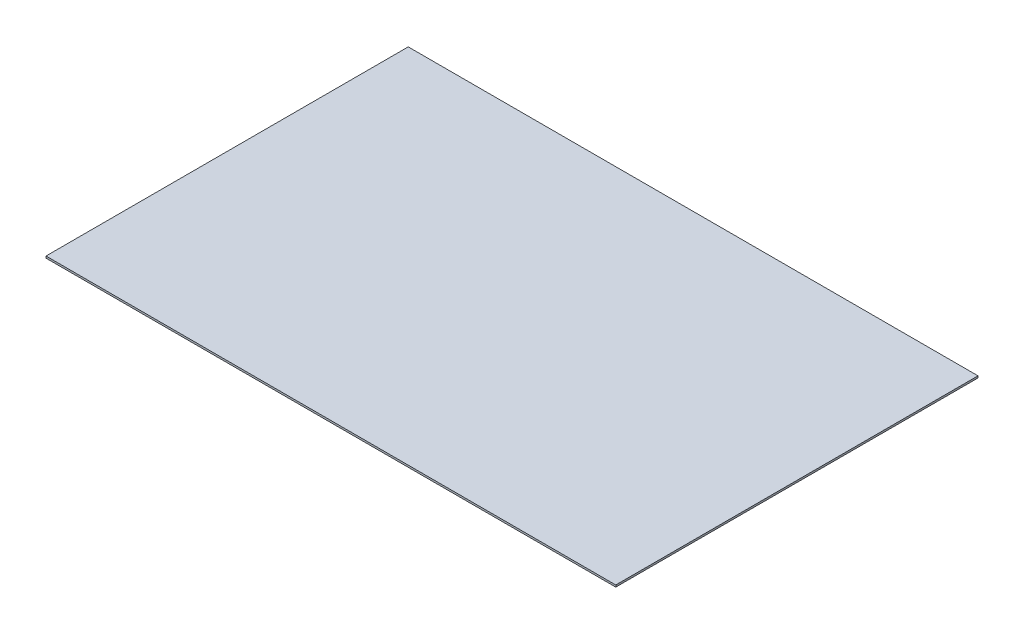
ISO-10303-21;
HEADER;
FILE_DESCRIPTION(('STEP AP214'),'2;1');
FILE_NAME('part.step','',(''),(''),'','','');
FILE_SCHEMA(('AUTOMOTIVE_DESIGN { 1 0 10303 214 1 1 1 1 }'));
ENDSEC;
DATA;
#1=APPLICATION_CONTEXT('core data for automotive mechanical design processes');
#2=APPLICATION_PROTOCOL_DEFINITION('international standard','automotive_design',2000,#1);
#3=PRODUCT_CONTEXT('',#1,'mechanical');
#4=PRODUCT('Part','Part','',(#3));
#5=PRODUCT_RELATED_PRODUCT_CATEGORY('part','',(#4));
#6=PRODUCT_DEFINITION_FORMATION('','',#4);
#7=PRODUCT_DEFINITION_CONTEXT('part definition',#1,'design');
#8=PRODUCT_DEFINITION('design','',#6,#7);
#9=PRODUCT_DEFINITION_SHAPE('','',#8);
#10=(LENGTH_UNIT() NAMED_UNIT(*) SI_UNIT(.MILLI.,.METRE.));
#11=(NAMED_UNIT(*) PLANE_ANGLE_UNIT() SI_UNIT($,.RADIAN.));
#12=(NAMED_UNIT(*) SI_UNIT($,.STERADIAN.) SOLID_ANGLE_UNIT());
#13=UNCERTAINTY_MEASURE_WITH_UNIT(LENGTH_MEASURE(1.E-05),#10,'distance_accuracy_value','');
#14=(GEOMETRIC_REPRESENTATION_CONTEXT(3) GLOBAL_UNCERTAINTY_ASSIGNED_CONTEXT((#13)) GLOBAL_UNIT_ASSIGNED_CONTEXT((#10,
#11,#12)) REPRESENTATION_CONTEXT('',''));
#15=CARTESIAN_POINT('',(0.,0.,0.));
#16=DIRECTION('',(0.,0.,1.));
#17=DIRECTION('',(1.,0.,0.));
#18=AXIS2_PLACEMENT_3D('',#15,#16,#17);
#19=CARTESIAN_POINT('',(239.7125,1.5875,-152.4));
#20=DIRECTION('',(-1.,0.,0.));
#21=DIRECTION('',(0.,0.,1.));
#22=AXIS2_PLACEMENT_3D('',#19,#20,#21);
#23=PLANE('',#22);
#24=DIRECTION('',(0.,0.,-1.));
#25=VECTOR('',#24,1.);
#26=CARTESIAN_POINT('',(239.7125,0.,-152.4));
#27=LINE('',#26,#25);
#28=CARTESIAN_POINT('',(239.7125,0.,152.4));
#29=VERTEX_POINT('',#28);
#30=CARTESIAN_POINT('',(239.7125,0.,-152.4));
#31=VERTEX_POINT('',#30);
#32=EDGE_CURVE('E98',#29,#31,#27,.T.);
#33=ORIENTED_EDGE('',*,*,#32,.T.);
#34=DIRECTION('',(0.,-1.,0.));
#35=VECTOR('',#34,1.);
#36=CARTESIAN_POINT('',(239.7125,1.5875,-152.4));
#37=LINE('',#36,#35);
#38=CARTESIAN_POINT('',(239.7125,1.5875,-152.4));
#39=VERTEX_POINT('',#38);
#40=EDGE_CURVE('E11',#39,#31,#37,.T.);
#41=ORIENTED_EDGE('',*,*,#40,.F.);
#42=DIRECTION('',(0.,0.,-1.));
#43=VECTOR('',#42,1.);
#44=CARTESIAN_POINT('',(239.7125,1.5875,-152.4));
#45=LINE('',#44,#43);
#46=CARTESIAN_POINT('',(239.7125,1.5875,152.4));
#47=VERTEX_POINT('',#46);
#48=EDGE_CURVE('E86',#47,#39,#45,.T.);
#49=ORIENTED_EDGE('',*,*,#48,.F.);
#50=DIRECTION('',(0.,-1.,0.));
#51=VECTOR('',#50,1.);
#52=CARTESIAN_POINT('',(239.7125,1.5875,152.4));
#53=LINE('',#52,#51);
#54=EDGE_CURVE('E94',#47,#29,#53,.T.);
#55=ORIENTED_EDGE('',*,*,#54,.T.);
#56=EDGE_LOOP('',(#33,#41,#49,#55));
#57=FACE_BOUND('',#56,.T.);
#58=ADVANCED_FACE('F35',(#57),#23,.F.);
#59=CARTESIAN_POINT('',(-239.7125,1.5875,-152.4));
#60=DIRECTION('',(0.,0.,1.));
#61=DIRECTION('',(1.,0.,0.));
#62=AXIS2_PLACEMENT_3D('',#59,#60,#61);
#63=PLANE('',#62);
#64=DIRECTION('',(-1.,0.,0.));
#65=VECTOR('',#64,1.);
#66=CARTESIAN_POINT('',(-239.7125,0.,-152.4));
#67=LINE('',#66,#65);
#68=CARTESIAN_POINT('',(-239.7125,0.,-152.4));
#69=VERTEX_POINT('',#68);
#70=EDGE_CURVE('E90',#31,#69,#67,.T.);
#71=ORIENTED_EDGE('',*,*,#70,.T.);
#72=DIRECTION('',(0.,-1.,0.));
#73=VECTOR('',#72,1.);
#74=CARTESIAN_POINT('',(-239.7125,1.5875,-152.4));
#75=LINE('',#74,#73);
#76=CARTESIAN_POINT('',(-239.7125,1.5875,-152.4));
#77=VERTEX_POINT('',#76);
#78=EDGE_CURVE('E43',#77,#69,#75,.T.);
#79=ORIENTED_EDGE('',*,*,#78,.F.);
#80=DIRECTION('',(-1.,0.,0.));
#81=VECTOR('',#80,1.);
#82=CARTESIAN_POINT('',(-239.7125,1.5875,-152.4));
#83=LINE('',#82,#81);
#84=EDGE_CURVE('E81',#39,#77,#83,.T.);
#85=ORIENTED_EDGE('',*,*,#84,.F.);
#86=ORIENTED_EDGE('',*,*,#40,.T.);
#87=EDGE_LOOP('',(#71,#79,#85,#86));
#88=FACE_BOUND('',#87,.T.);
#89=ADVANCED_FACE('F89',(#88),#63,.F.);
#90=CARTESIAN_POINT('',(-239.7125,1.5875,-152.4));
#91=DIRECTION('',(1.,0.,0.));
#92=DIRECTION('',(0.,0.,-1.));
#93=AXIS2_PLACEMENT_3D('',#90,#91,#92);
#94=PLANE('',#93);
#95=DIRECTION('',(0.,0.,1.));
#96=VECTOR('',#95,1.);
#97=CARTESIAN_POINT('',(-239.7125,0.,-152.4));
#98=LINE('',#97,#96);
#99=CARTESIAN_POINT('',(-239.7125,0.,152.4));
#100=VERTEX_POINT('',#99);
#101=EDGE_CURVE('E68',#69,#100,#98,.T.);
#102=ORIENTED_EDGE('',*,*,#101,.T.);
#103=DIRECTION('',(0.,-1.,0.));
#104=VECTOR('',#103,1.);
#105=CARTESIAN_POINT('',(-239.7125,1.5875,152.4));
#106=LINE('',#105,#104);
#107=CARTESIAN_POINT('',(-239.7125,1.5875,152.4));
#108=VERTEX_POINT('',#107);
#109=EDGE_CURVE('E91',#108,#100,#106,.T.);
#110=ORIENTED_EDGE('',*,*,#109,.F.);
#111=DIRECTION('',(0.,0.,1.));
#112=VECTOR('',#111,1.);
#113=CARTESIAN_POINT('',(-239.7125,1.5875,-152.4));
#114=LINE('',#113,#112);
#115=EDGE_CURVE('E84',#77,#108,#114,.T.);
#116=ORIENTED_EDGE('',*,*,#115,.F.);
#117=ORIENTED_EDGE('',*,*,#78,.T.);
#118=EDGE_LOOP('',(#102,#110,#116,#117));
#119=FACE_BOUND('',#118,.T.);
#120=ADVANCED_FACE('F92',(#119),#94,.F.);
#121=CARTESIAN_POINT('',(-239.7125,1.5875,152.4));
#122=DIRECTION('',(0.,0.,-1.));
#123=DIRECTION('',(-1.,0.,0.));
#124=AXIS2_PLACEMENT_3D('',#121,#122,#123);
#125=PLANE('',#124);
#126=DIRECTION('',(1.,0.,0.));
#127=VECTOR('',#126,1.);
#128=CARTESIAN_POINT('',(-239.7125,0.,152.4));
#129=LINE('',#128,#127);
#130=EDGE_CURVE('E74',#100,#29,#129,.T.);
#131=ORIENTED_EDGE('',*,*,#130,.T.);
#132=ORIENTED_EDGE('',*,*,#54,.F.);
#133=DIRECTION('',(1.,0.,0.));
#134=VECTOR('',#133,1.);
#135=CARTESIAN_POINT('',(-239.7125,1.5875,152.4));
#136=LINE('',#135,#134);
#137=EDGE_CURVE('E51',#108,#47,#136,.T.);
#138=ORIENTED_EDGE('',*,*,#137,.F.);
#139=ORIENTED_EDGE('',*,*,#109,.T.);
#140=EDGE_LOOP('',(#131,#132,#138,#139));
#141=FACE_BOUND('',#140,.T.);
#142=ADVANCED_FACE('F105',(#141),#125,.F.);
#143=CARTESIAN_POINT('',(0.,1.5875,0.));
#144=DIRECTION('',(0.,1.,0.));
#145=DIRECTION('',(0.,0.,1.));
#146=AXIS2_PLACEMENT_3D('',#143,#144,#145);
#147=PLANE('',#146);
#148=ORIENTED_EDGE('',*,*,#48,.T.);
#149=ORIENTED_EDGE('',*,*,#84,.T.);
#150=ORIENTED_EDGE('',*,*,#115,.T.);
#151=ORIENTED_EDGE('',*,*,#137,.T.);
#152=EDGE_LOOP('',(#148,#149,#150,#151));
#153=FACE_BOUND('',#152,.T.);
#154=ADVANCED_FACE('F82',(#153),#147,.T.);
#155=CARTESIAN_POINT('',(0.,0.,0.));
#156=DIRECTION('',(0.,1.,0.));
#157=DIRECTION('',(0.,0.,1.));
#158=AXIS2_PLACEMENT_3D('',#155,#156,#157);
#159=PLANE('',#158);
#160=ORIENTED_EDGE('',*,*,#32,.F.);
#161=ORIENTED_EDGE('',*,*,#130,.F.);
#162=ORIENTED_EDGE('',*,*,#101,.F.);
#163=ORIENTED_EDGE('',*,*,#70,.F.);
#164=EDGE_LOOP('',(#160,#161,#162,#163));
#165=FACE_BOUND('',#164,.T.);
#166=ADVANCED_FACE('F108',(#165),#159,.F.);
#167=CLOSED_SHELL('',(#58,#89,#120,#142,#154,#166));
#168=MANIFOLD_SOLID_BREP('B2',#167);
#169=ADVANCED_BREP_SHAPE_REPRESENTATION('',(#18,#168),#14);
#170=SHAPE_DEFINITION_REPRESENTATION(#9,#169);
ENDSEC;
END-ISO-10303-21;
